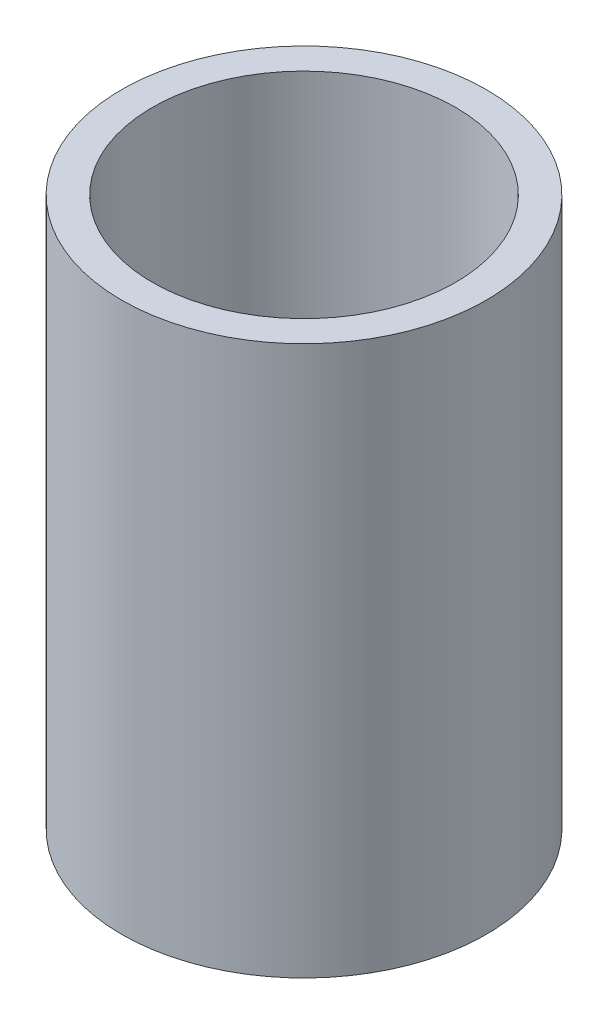
ISO-10303-21;
HEADER;
FILE_DESCRIPTION(('STEP AP214'),'2;1');
FILE_NAME('part.step','',(''),(''),'','','');
FILE_SCHEMA(('AUTOMOTIVE_DESIGN { 1 0 10303 214 1 1 1 1 }'));
ENDSEC;
DATA;
#1=APPLICATION_CONTEXT('core data for automotive mechanical design processes');
#2=APPLICATION_PROTOCOL_DEFINITION('international standard','automotive_design',2000,#1);
#3=PRODUCT_CONTEXT('',#1,'mechanical');
#4=PRODUCT('Part','Part','',(#3));
#5=PRODUCT_RELATED_PRODUCT_CATEGORY('part','',(#4));
#6=PRODUCT_DEFINITION_FORMATION('','',#4);
#7=PRODUCT_DEFINITION_CONTEXT('part definition',#1,'design');
#8=PRODUCT_DEFINITION('design','',#6,#7);
#9=PRODUCT_DEFINITION_SHAPE('','',#8);
#10=(LENGTH_UNIT() NAMED_UNIT(*) SI_UNIT(.MILLI.,.METRE.));
#11=(NAMED_UNIT(*) PLANE_ANGLE_UNIT() SI_UNIT($,.RADIAN.));
#12=(NAMED_UNIT(*) SI_UNIT($,.STERADIAN.) SOLID_ANGLE_UNIT());
#13=UNCERTAINTY_MEASURE_WITH_UNIT(LENGTH_MEASURE(1.E-05),#10,'distance_accuracy_value','');
#14=(GEOMETRIC_REPRESENTATION_CONTEXT(3) GLOBAL_UNCERTAINTY_ASSIGNED_CONTEXT((#13)) GLOBAL_UNIT_ASSIGNED_CONTEXT((#10,
#11,#12)) REPRESENTATION_CONTEXT('',''));
#15=CARTESIAN_POINT('',(0.,0.,0.));
#16=DIRECTION('',(0.,0.,1.));
#17=DIRECTION('',(1.,0.,0.));
#18=AXIS2_PLACEMENT_3D('',#15,#16,#17);
#19=CARTESIAN_POINT('',(0.,63.5,0.));
#20=DIRECTION('',(0.,1.,0.));
#21=DIRECTION('',(0.,0.,-1.));
#22=AXIS2_PLACEMENT_3D('',#19,#20,#21);
#23=PLANE('',#22);
#24=CARTESIAN_POINT('',(0.,63.5,0.));
#25=DIRECTION('',(0.,-1.,0.));
#26=DIRECTION('',(0.,0.,-1.));
#27=AXIS2_PLACEMENT_3D('',#24,#25,#26);
#28=CIRCLE('',#27,21.082);
#29=CARTESIAN_POINT('',(0.,63.5,-21.082));
#30=VERTEX_POINT('',#29);
#31=EDGE_CURVE('E10',#30,#30,#28,.T.);
#32=ORIENTED_EDGE('',*,*,#31,.F.);
#33=EDGE_LOOP('',(#32));
#34=FACE_BOUND('',#33,.T.);
#35=CARTESIAN_POINT('',(0.,63.5,0.));
#36=DIRECTION('',(0.,-1.,0.));
#37=DIRECTION('',(0.,0.,-1.));
#38=AXIS2_PLACEMENT_3D('',#35,#36,#37);
#39=CIRCLE('',#38,17.526);
#40=CARTESIAN_POINT('',(0.,63.5,-17.526));
#41=VERTEX_POINT('',#40);
#42=EDGE_CURVE('E48',#41,#41,#39,.T.);
#43=ORIENTED_EDGE('',*,*,#42,.T.);
#44=EDGE_LOOP('',(#43));
#45=FACE_BOUND('',#44,.T.);
#46=ADVANCED_FACE('F37',(#34,#45),#23,.T.);
#47=CARTESIAN_POINT('',(0.,0.,0.));
#48=DIRECTION('',(0.,1.,0.));
#49=DIRECTION('',(0.,0.,-1.));
#50=AXIS2_PLACEMENT_3D('',#47,#48,#49);
#51=PLANE('',#50);
#52=CARTESIAN_POINT('',(0.,0.,0.));
#53=DIRECTION('',(0.,-1.,0.));
#54=DIRECTION('',(0.,0.,-1.));
#55=AXIS2_PLACEMENT_3D('',#52,#53,#54);
#56=CIRCLE('',#55,21.082);
#57=CARTESIAN_POINT('',(0.,0.,-21.082));
#58=VERTEX_POINT('',#57);
#59=EDGE_CURVE('E41',#58,#58,#56,.T.);
#60=ORIENTED_EDGE('',*,*,#59,.T.);
#61=EDGE_LOOP('',(#60));
#62=FACE_BOUND('',#61,.T.);
#63=CARTESIAN_POINT('',(0.,0.,0.));
#64=DIRECTION('',(0.,-1.,0.));
#65=DIRECTION('',(0.,0.,-1.));
#66=AXIS2_PLACEMENT_3D('',#63,#64,#65);
#67=CIRCLE('',#66,17.526);
#68=CARTESIAN_POINT('',(0.,0.,-17.526));
#69=VERTEX_POINT('',#68);
#70=EDGE_CURVE('E50',#69,#69,#67,.T.);
#71=ORIENTED_EDGE('',*,*,#70,.F.);
#72=EDGE_LOOP('',(#71));
#73=FACE_BOUND('',#72,.T.);
#74=ADVANCED_FACE('F63',(#62,#73),#51,.F.);
#75=CARTESIAN_POINT('',(0.,63.5,0.));
#76=DIRECTION('',(0.,-1.,0.));
#77=DIRECTION('',(0.,0.,1.));
#78=AXIS2_PLACEMENT_3D('',#75,#76,#77);
#79=CYLINDRICAL_SURFACE('',#78,21.082);
#80=ORIENTED_EDGE('',*,*,#31,.T.);
#81=EDGE_LOOP('',(#80));
#82=FACE_BOUND('',#81,.T.);
#83=ORIENTED_EDGE('',*,*,#59,.F.);
#84=EDGE_LOOP('',(#83));
#85=FACE_BOUND('',#84,.T.);
#86=ADVANCED_FACE('F39',(#82,#85),#79,.T.);
#87=CARTESIAN_POINT('',(0.,63.5,0.));
#88=DIRECTION('',(0.,-1.,0.));
#89=DIRECTION('',(0.,0.,1.));
#90=AXIS2_PLACEMENT_3D('',#87,#88,#89);
#91=CYLINDRICAL_SURFACE('',#90,17.526);
#92=ORIENTED_EDGE('',*,*,#42,.F.);
#93=EDGE_LOOP('',(#92));
#94=FACE_BOUND('',#93,.T.);
#95=ORIENTED_EDGE('',*,*,#70,.T.);
#96=EDGE_LOOP('',(#95));
#97=FACE_BOUND('',#96,.T.);
#98=ADVANCED_FACE('F57',(#94,#97),#91,.F.);
#99=CLOSED_SHELL('',(#46,#74,#86,#98));
#100=MANIFOLD_SOLID_BREP('B2',#99);
#101=ADVANCED_BREP_SHAPE_REPRESENTATION('',(#18,#100),#14);
#102=SHAPE_DEFINITION_REPRESENTATION(#9,#101);
ENDSEC;
END-ISO-10303-21;
